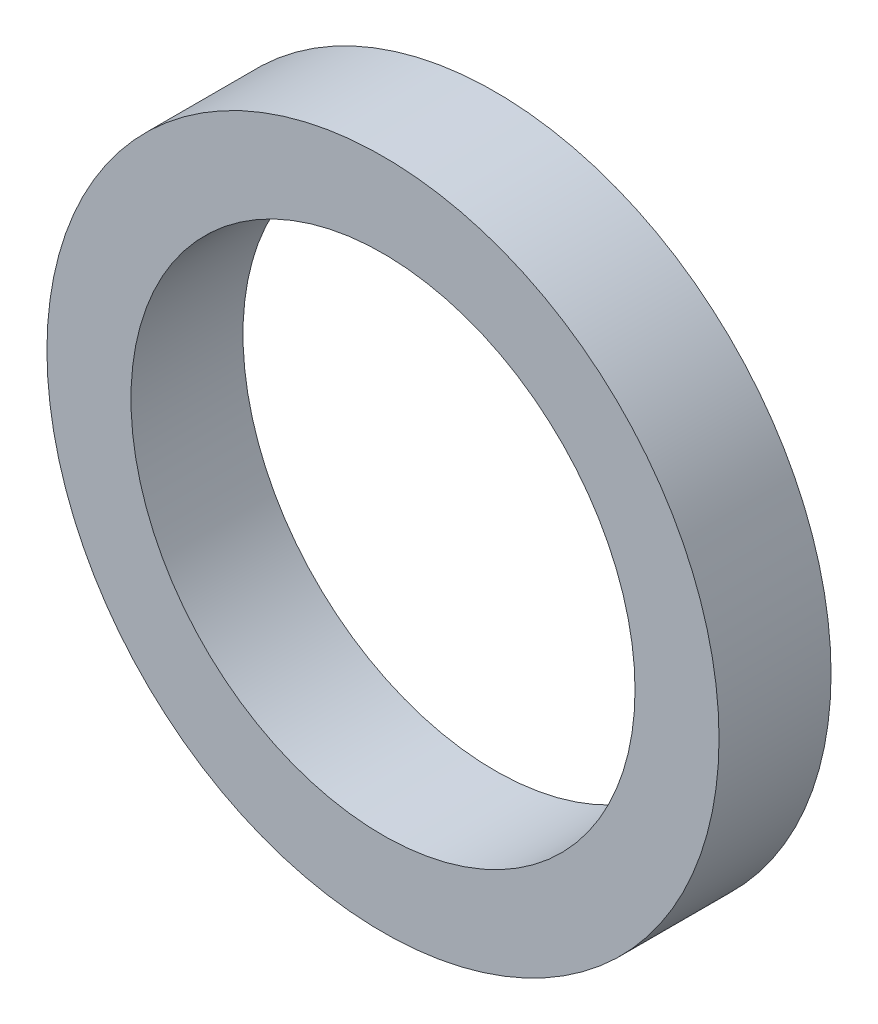
ISO-10303-21;
HEADER;
FILE_DESCRIPTION(('STEP AP214'),'2;1');
FILE_NAME('part.step','',(''),(''),'','','');
FILE_SCHEMA(('AUTOMOTIVE_DESIGN { 1 0 10303 214 1 1 1 1 }'));
ENDSEC;
DATA;
#1=APPLICATION_CONTEXT('core data for automotive mechanical design processes');
#2=APPLICATION_PROTOCOL_DEFINITION('international standard','automotive_design',2000,#1);
#3=PRODUCT_CONTEXT('',#1,'mechanical');
#4=PRODUCT('Part','Part','',(#3));
#5=PRODUCT_RELATED_PRODUCT_CATEGORY('part','',(#4));
#6=PRODUCT_DEFINITION_FORMATION('','',#4);
#7=PRODUCT_DEFINITION_CONTEXT('part definition',#1,'design');
#8=PRODUCT_DEFINITION('design','',#6,#7);
#9=PRODUCT_DEFINITION_SHAPE('','',#8);
#10=(LENGTH_UNIT() NAMED_UNIT(*) SI_UNIT(.MILLI.,.METRE.));
#11=(NAMED_UNIT(*) PLANE_ANGLE_UNIT() SI_UNIT($,.RADIAN.));
#12=(NAMED_UNIT(*) SI_UNIT($,.STERADIAN.) SOLID_ANGLE_UNIT());
#13=UNCERTAINTY_MEASURE_WITH_UNIT(LENGTH_MEASURE(1.E-05),#10,'distance_accuracy_value','');
#14=(GEOMETRIC_REPRESENTATION_CONTEXT(3) GLOBAL_UNCERTAINTY_ASSIGNED_CONTEXT((#13)) GLOBAL_UNIT_ASSIGNED_CONTEXT((#10,
#11,#12)) REPRESENTATION_CONTEXT('',''));
#15=CARTESIAN_POINT('',(0.,0.,0.));
#16=DIRECTION('',(0.,0.,1.));
#17=DIRECTION('',(1.,0.,0.));
#18=AXIS2_PLACEMENT_3D('',#15,#16,#17);
#19=CARTESIAN_POINT('',(0.,0.,1.));
#20=DIRECTION('',(0.,0.,1.));
#21=DIRECTION('',(1.,0.,0.));
#22=AXIS2_PLACEMENT_3D('',#19,#20,#21);
#23=PLANE('',#22);
#24=CARTESIAN_POINT('',(0.,0.,1.));
#25=DIRECTION('',(0.,0.,1.));
#26=DIRECTION('',(1.,0.,0.));
#27=AXIS2_PLACEMENT_3D('',#24,#25,#26);
#28=CIRCLE('',#27,3.);
#29=CARTESIAN_POINT('',(3.,0.,1.));
#30=VERTEX_POINT('',#29);
#31=EDGE_CURVE('E10',#30,#30,#28,.T.);
#32=ORIENTED_EDGE('',*,*,#31,.T.);
#33=EDGE_LOOP('',(#32));
#34=FACE_BOUND('',#33,.T.);
#35=CARTESIAN_POINT('',(0.,0.,1.));
#36=DIRECTION('',(0.,0.,1.));
#37=DIRECTION('',(1.,0.,0.));
#38=AXIS2_PLACEMENT_3D('',#35,#36,#37);
#39=CIRCLE('',#38,2.25);
#40=CARTESIAN_POINT('',(2.25,0.,1.));
#41=VERTEX_POINT('',#40);
#42=EDGE_CURVE('E45',#41,#41,#39,.T.);
#43=ORIENTED_EDGE('',*,*,#42,.F.);
#44=EDGE_LOOP('',(#43));
#45=FACE_BOUND('',#44,.T.);
#46=ADVANCED_FACE('F34',(#34,#45),#23,.T.);
#47=CARTESIAN_POINT('',(0.,0.,0.));
#48=DIRECTION('',(0.,0.,1.));
#49=DIRECTION('',(1.,0.,0.));
#50=AXIS2_PLACEMENT_3D('',#47,#48,#49);
#51=PLANE('',#50);
#52=CARTESIAN_POINT('',(0.,0.,0.));
#53=DIRECTION('',(0.,0.,1.));
#54=DIRECTION('',(1.,0.,0.));
#55=AXIS2_PLACEMENT_3D('',#52,#53,#54);
#56=CIRCLE('',#55,3.);
#57=CARTESIAN_POINT('',(3.,0.,0.));
#58=VERTEX_POINT('',#57);
#59=EDGE_CURVE('E38',#58,#58,#56,.T.);
#60=ORIENTED_EDGE('',*,*,#59,.F.);
#61=EDGE_LOOP('',(#60));
#62=FACE_BOUND('',#61,.T.);
#63=CARTESIAN_POINT('',(0.,0.,0.));
#64=DIRECTION('',(0.,0.,1.));
#65=DIRECTION('',(1.,0.,0.));
#66=AXIS2_PLACEMENT_3D('',#63,#64,#65);
#67=CIRCLE('',#66,2.25);
#68=CARTESIAN_POINT('',(2.25,0.,0.));
#69=VERTEX_POINT('',#68);
#70=EDGE_CURVE('E47',#69,#69,#67,.T.);
#71=ORIENTED_EDGE('',*,*,#70,.T.);
#72=EDGE_LOOP('',(#71));
#73=FACE_BOUND('',#72,.T.);
#74=ADVANCED_FACE('F57',(#62,#73),#51,.F.);
#75=CARTESIAN_POINT('',(0.,0.,1.));
#76=DIRECTION('',(0.,0.,-1.));
#77=DIRECTION('',(-1.,0.,0.));
#78=AXIS2_PLACEMENT_3D('',#75,#76,#77);
#79=CYLINDRICAL_SURFACE('',#78,3.);
#80=ORIENTED_EDGE('',*,*,#31,.F.);
#81=EDGE_LOOP('',(#80));
#82=FACE_BOUND('',#81,.T.);
#83=ORIENTED_EDGE('',*,*,#59,.T.);
#84=EDGE_LOOP('',(#83));
#85=FACE_BOUND('',#84,.T.);
#86=ADVANCED_FACE('F36',(#82,#85),#79,.T.);
#87=CARTESIAN_POINT('',(0.,0.,1.));
#88=DIRECTION('',(0.,0.,-1.));
#89=DIRECTION('',(-1.,0.,0.));
#90=AXIS2_PLACEMENT_3D('',#87,#88,#89);
#91=CYLINDRICAL_SURFACE('',#90,2.25);
#92=ORIENTED_EDGE('',*,*,#42,.T.);
#93=EDGE_LOOP('',(#92));
#94=FACE_BOUND('',#93,.T.);
#95=ORIENTED_EDGE('',*,*,#70,.F.);
#96=EDGE_LOOP('',(#95));
#97=FACE_BOUND('',#96,.T.);
#98=ADVANCED_FACE('F53',(#94,#97),#91,.F.);
#99=CLOSED_SHELL('',(#46,#74,#86,#98));
#100=MANIFOLD_SOLID_BREP('B2',#99);
#101=ADVANCED_BREP_SHAPE_REPRESENTATION('',(#18,#100),#14);
#102=SHAPE_DEFINITION_REPRESENTATION(#9,#101);
ENDSEC;
END-ISO-10303-21;
